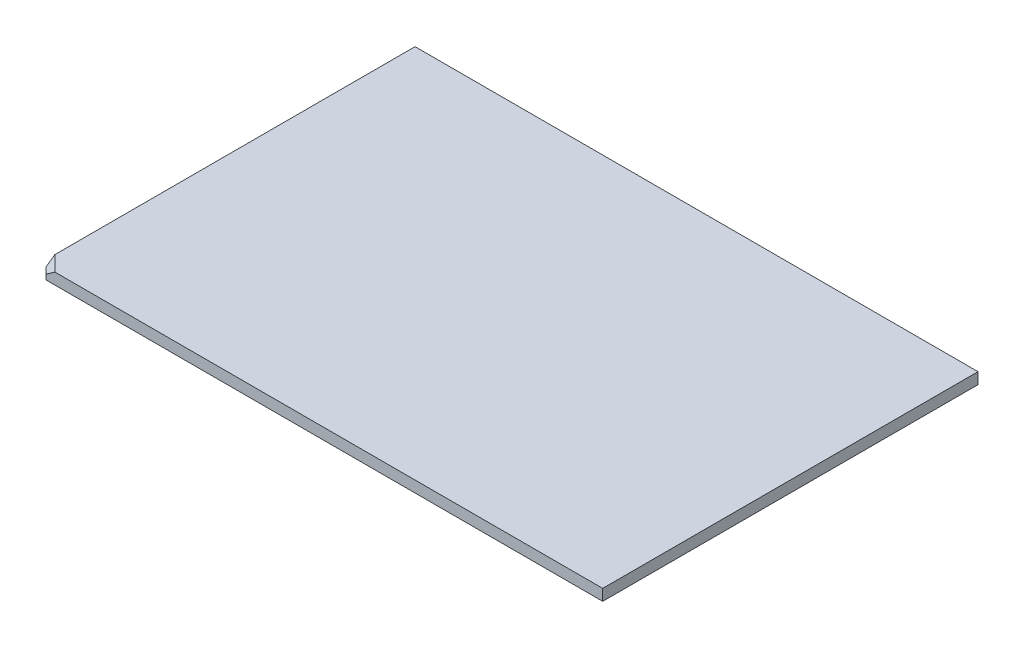
ISO-10303-21;
HEADER;
FILE_DESCRIPTION(('STEP AP214'),'2;1');
FILE_NAME('part.step','',(''),(''),'','','');
FILE_SCHEMA(('AUTOMOTIVE_DESIGN { 1 0 10303 214 1 1 1 1 }'));
ENDSEC;
DATA;
#1=APPLICATION_CONTEXT('core data for automotive mechanical design processes');
#2=APPLICATION_PROTOCOL_DEFINITION('international standard','automotive_design',2000,#1);
#3=PRODUCT_CONTEXT('',#1,'mechanical');
#4=PRODUCT('Part','Part','',(#3));
#5=PRODUCT_RELATED_PRODUCT_CATEGORY('part','',(#4));
#6=PRODUCT_DEFINITION_FORMATION('','',#4);
#7=PRODUCT_DEFINITION_CONTEXT('part definition',#1,'design');
#8=PRODUCT_DEFINITION('design','',#6,#7);
#9=PRODUCT_DEFINITION_SHAPE('','',#8);
#10=(LENGTH_UNIT() NAMED_UNIT(*) SI_UNIT(.MILLI.,.METRE.));
#11=(NAMED_UNIT(*) PLANE_ANGLE_UNIT() SI_UNIT($,.RADIAN.));
#12=(NAMED_UNIT(*) SI_UNIT($,.STERADIAN.) SOLID_ANGLE_UNIT());
#13=UNCERTAINTY_MEASURE_WITH_UNIT(LENGTH_MEASURE(1.E-05),#10,'distance_accuracy_value','');
#14=(GEOMETRIC_REPRESENTATION_CONTEXT(3) GLOBAL_UNCERTAINTY_ASSIGNED_CONTEXT((#13)) GLOBAL_UNIT_ASSIGNED_CONTEXT((#10,
#11,#12)) REPRESENTATION_CONTEXT('',''));
#15=CARTESIAN_POINT('',(0.,0.,0.));
#16=DIRECTION('',(0.,0.,1.));
#17=DIRECTION('',(1.,0.,0.));
#18=AXIS2_PLACEMENT_3D('',#15,#16,#17);
#19=CARTESIAN_POINT('',(-26.9712669172933,9.,-282.549436090226));
#20=DIRECTION('',(1.,0.,0.));
#21=DIRECTION('',(0.,0.,-1.));
#22=AXIS2_PLACEMENT_3D('',#19,#20,#21);
#23=PLANE('',#22);
#24=DIRECTION('',(0.,1.,0.));
#25=VECTOR('',#24,1.);
#26=CARTESIAN_POINT('',(-26.9712669172932,9.,12.4505639097744));
#27=LINE('',#26,#25);
#28=CARTESIAN_POINT('',(-26.9712669172932,0.,12.4505639097744));
#29=VERTEX_POINT('',#28);
#30=CARTESIAN_POINT('',(-26.9712669172932,3.99999999999999,12.4505639097744));
#31=VERTEX_POINT('',#30);
#32=EDGE_CURVE('E130',#29,#31,#27,.T.);
#33=ORIENTED_EDGE('',*,*,#32,.T.);
#34=DIRECTION('',(0.,0.577350269189624,-0.816496580927727));
#35=VECTOR('',#34,1.);
#36=CARTESIAN_POINT('',(-26.9712669172932,3.91077081192918,12.5767530377037));
#37=LINE('',#36,#35);
#38=CARTESIAN_POINT('',(-26.9712669172932,8.99999999999998,5.37949609790893));
#39=VERTEX_POINT('',#38);
#40=EDGE_CURVE('E11',#31,#39,#37,.T.);
#41=ORIENTED_EDGE('',*,*,#40,.T.);
#42=DIRECTION('',(0.,0.,1.));
#43=VECTOR('',#42,1.);
#44=CARTESIAN_POINT('',(-26.9712669172933,9.,-282.549436090226));
#45=LINE('',#44,#43);
#46=CARTESIAN_POINT('',(-26.9712669172933,9.,-282.549436090226));
#47=VERTEX_POINT('',#46);
#48=EDGE_CURVE('E95',#47,#39,#45,.T.);
#49=ORIENTED_EDGE('',*,*,#48,.F.);
#50=DIRECTION('',(0.,-1.,0.));
#51=VECTOR('',#50,1.);
#52=CARTESIAN_POINT('',(-26.9712669172933,9.,-282.549436090226));
#53=LINE('',#52,#51);
#54=CARTESIAN_POINT('',(-26.9712669172933,0.,-282.549436090226));
#55=VERTEX_POINT('',#54);
#56=EDGE_CURVE('E112',#47,#55,#53,.T.);
#57=ORIENTED_EDGE('',*,*,#56,.T.);
#58=DIRECTION('',(0.,0.,1.));
#59=VECTOR('',#58,1.);
#60=CARTESIAN_POINT('',(-26.9712669172933,0.,-282.549436090226));
#61=LINE('',#60,#59);
#62=EDGE_CURVE('E116',#55,#29,#61,.T.);
#63=ORIENTED_EDGE('',*,*,#62,.T.);
#64=EDGE_LOOP('',(#33,#41,#49,#57,#63));
#65=FACE_BOUND('',#64,.T.);
#66=ADVANCED_FACE('F35',(#65),#23,.F.);
#67=CARTESIAN_POINT('',(-26.9712669172932,9.,17.4505639097744));
#68=DIRECTION('',(0.,0.,-1.));
#69=DIRECTION('',(-1.,0.,0.));
#70=AXIS2_PLACEMENT_3D('',#67,#68,#69);
#71=PLANE('',#70);
#72=DIRECTION('',(1.,0.,0.));
#73=VECTOR('',#72,1.);
#74=CARTESIAN_POINT('',(-26.9712669172932,9.,17.4505639097744));
#75=LINE('',#74,#73);
#76=CARTESIAN_POINT('',(-14.9001991054277,9.,17.4505639097744));
#77=VERTEX_POINT('',#76);
#78=CARTESIAN_POINT('',(423.028733082707,9.,17.4505639097744));
#79=VERTEX_POINT('',#78);
#80=EDGE_CURVE('E86',#77,#79,#75,.T.);
#81=ORIENTED_EDGE('',*,*,#80,.F.);
#82=DIRECTION('',(-0.816496580927726,-0.577350269189626,0.));
#83=VECTOR('',#82,1.);
#84=CARTESIAN_POINT('',(-15.7503207068767,8.3988732507823,17.4505639097744));
#85=LINE('',#84,#83);
#86=CARTESIAN_POINT('',(-21.9712669172932,4.,17.4505639097744));
#87=VERTEX_POINT('',#86);
#88=EDGE_CURVE('E57',#77,#87,#85,.T.);
#89=ORIENTED_EDGE('',*,*,#88,.T.);
#90=DIRECTION('',(0.,-1.,0.));
#91=VECTOR('',#90,1.);
#92=CARTESIAN_POINT('',(-21.9712669172932,9.,17.4505639097744));
#93=LINE('',#92,#91);
#94=CARTESIAN_POINT('',(-21.9712669172932,0.,17.4505639097744));
#95=VERTEX_POINT('',#94);
#96=EDGE_CURVE('E104',#87,#95,#93,.T.);
#97=ORIENTED_EDGE('',*,*,#96,.T.);
#98=DIRECTION('',(1.,0.,0.));
#99=VECTOR('',#98,1.);
#100=CARTESIAN_POINT('',(-26.9712669172932,0.,17.4505639097744));
#101=LINE('',#100,#99);
#102=CARTESIAN_POINT('',(423.028733082707,0.,17.4505639097744));
#103=VERTEX_POINT('',#102);
#104=EDGE_CURVE('E101',#95,#103,#101,.T.);
#105=ORIENTED_EDGE('',*,*,#104,.T.);
#106=DIRECTION('',(0.,-1.,0.));
#107=VECTOR('',#106,1.);
#108=CARTESIAN_POINT('',(423.028733082707,9.,17.4505639097744));
#109=LINE('',#108,#107);
#110=EDGE_CURVE('E98',#79,#103,#109,.T.);
#111=ORIENTED_EDGE('',*,*,#110,.F.);
#112=EDGE_LOOP('',(#81,#89,#97,#105,#111));
#113=FACE_BOUND('',#112,.T.);
#114=ADVANCED_FACE('F99',(#113),#71,.F.);
#115=CARTESIAN_POINT('',(423.028733082707,9.,-282.549436090226));
#116=DIRECTION('',(-1.,0.,0.));
#117=DIRECTION('',(0.,0.,1.));
#118=AXIS2_PLACEMENT_3D('',#115,#116,#117);
#119=PLANE('',#118);
#120=DIRECTION('',(0.,0.,-1.));
#121=VECTOR('',#120,1.);
#122=CARTESIAN_POINT('',(423.028733082707,0.,-282.549436090226));
#123=LINE('',#122,#121);
#124=CARTESIAN_POINT('',(423.028733082707,0.,-282.549436090226));
#125=VERTEX_POINT('',#124);
#126=EDGE_CURVE('E120',#103,#125,#123,.T.);
#127=ORIENTED_EDGE('',*,*,#126,.T.);
#128=DIRECTION('',(0.,-1.,0.));
#129=VECTOR('',#128,1.);
#130=CARTESIAN_POINT('',(423.028733082707,9.,-282.549436090226));
#131=LINE('',#130,#129);
#132=CARTESIAN_POINT('',(423.028733082707,9.,-282.549436090226));
#133=VERTEX_POINT('',#132);
#134=EDGE_CURVE('E105',#133,#125,#131,.T.);
#135=ORIENTED_EDGE('',*,*,#134,.F.);
#136=DIRECTION('',(0.,0.,-1.));
#137=VECTOR('',#136,1.);
#138=CARTESIAN_POINT('',(423.028733082707,9.,-282.549436090226));
#139=LINE('',#138,#137);
#140=EDGE_CURVE('E91',#79,#133,#139,.T.);
#141=ORIENTED_EDGE('',*,*,#140,.F.);
#142=ORIENTED_EDGE('',*,*,#110,.T.);
#143=EDGE_LOOP('',(#127,#135,#141,#142));
#144=FACE_BOUND('',#143,.T.);
#145=ADVANCED_FACE('F107',(#144),#119,.F.);
#146=CARTESIAN_POINT('',(-26.9712669172933,9.,-282.549436090226));
#147=DIRECTION('',(0.,0.,1.));
#148=DIRECTION('',(1.,0.,0.));
#149=AXIS2_PLACEMENT_3D('',#146,#147,#148);
#150=PLANE('',#149);
#151=DIRECTION('',(-1.,0.,0.));
#152=VECTOR('',#151,1.);
#153=CARTESIAN_POINT('',(-26.9712669172933,0.,-282.549436090226));
#154=LINE('',#153,#152);
#155=EDGE_CURVE('E122',#125,#55,#154,.T.);
#156=ORIENTED_EDGE('',*,*,#155,.T.);
#157=ORIENTED_EDGE('',*,*,#56,.F.);
#158=DIRECTION('',(-1.,0.,0.));
#159=VECTOR('',#158,1.);
#160=CARTESIAN_POINT('',(-26.9712669172933,9.,-282.549436090226));
#161=LINE('',#160,#159);
#162=EDGE_CURVE('E110',#133,#47,#161,.T.);
#163=ORIENTED_EDGE('',*,*,#162,.F.);
#164=ORIENTED_EDGE('',*,*,#134,.T.);
#165=EDGE_LOOP('',(#156,#157,#163,#164));
#166=FACE_BOUND('',#165,.T.);
#167=ADVANCED_FACE('F155',(#166),#150,.F.);
#168=CARTESIAN_POINT('',(0.,9.,0.));
#169=DIRECTION('',(0.,1.,0.));
#170=DIRECTION('',(0.,0.,1.));
#171=AXIS2_PLACEMENT_3D('',#168,#169,#170);
#172=PLANE('',#171);
#173=ORIENTED_EDGE('',*,*,#48,.T.);
#174=DIRECTION('',(0.707106781186546,0.,0.707106781186549));
#175=VECTOR('',#174,1.);
#176=CARTESIAN_POINT('',(-16.1753815076011,9.,16.175381507601));
#177=LINE('',#176,#175);
#178=EDGE_CURVE('E94',#39,#77,#177,.T.);
#179=ORIENTED_EDGE('',*,*,#178,.T.);
#180=ORIENTED_EDGE('',*,*,#80,.T.);
#181=ORIENTED_EDGE('',*,*,#140,.T.);
#182=ORIENTED_EDGE('',*,*,#162,.T.);
#183=EDGE_LOOP('',(#173,#179,#180,#181,#182));
#184=FACE_BOUND('',#183,.T.);
#185=ADVANCED_FACE('F89',(#184),#172,.T.);
#186=CARTESIAN_POINT('',(0.,0.,0.));
#187=DIRECTION('',(0.,1.,0.));
#188=DIRECTION('',(0.,0.,1.));
#189=AXIS2_PLACEMENT_3D('',#186,#187,#188);
#190=PLANE('',#189);
#191=ORIENTED_EDGE('',*,*,#104,.F.);
#192=DIRECTION('',(0.707106781186546,0.,0.707106781186549));
#193=VECTOR('',#192,1.);
#194=CARTESIAN_POINT('',(-21.9712669172932,0.,17.4505639097744));
#195=LINE('',#194,#193);
#196=EDGE_CURVE('E128',#95,#29,#195,.F.);
#197=ORIENTED_EDGE('',*,*,#196,.T.);
#198=ORIENTED_EDGE('',*,*,#62,.F.);
#199=ORIENTED_EDGE('',*,*,#155,.F.);
#200=ORIENTED_EDGE('',*,*,#126,.F.);
#201=EDGE_LOOP('',(#191,#197,#198,#199,#200));
#202=FACE_BOUND('',#201,.T.);
#203=ADVANCED_FACE('F144',(#202),#190,.F.);
#204=CARTESIAN_POINT('',(-21.9712669172932,9.,17.4505639097744));
#205=DIRECTION('',(0.707106781186549,0.,-0.707106781186545));
#206=DIRECTION('',(0.,-1.,0.));
#207=AXIS2_PLACEMENT_3D('',#204,#205,#206);
#208=PLANE('',#207);
#209=ORIENTED_EDGE('',*,*,#96,.F.);
#210=DIRECTION('',(0.707106781186546,0.,0.707106781186549));
#211=VECTOR('',#210,1.);
#212=CARTESIAN_POINT('',(-21.9712669172932,4.,17.4505639097744));
#213=LINE('',#212,#211);
#214=EDGE_CURVE('E43',#87,#31,#213,.F.);
#215=ORIENTED_EDGE('',*,*,#214,.T.);
#216=ORIENTED_EDGE('',*,*,#32,.F.);
#217=ORIENTED_EDGE('',*,*,#196,.F.);
#218=EDGE_LOOP('',(#209,#215,#216,#217));
#219=FACE_BOUND('',#218,.T.);
#220=ADVANCED_FACE('F140',(#219),#208,.F.);
#221=CARTESIAN_POINT('',(-16.1753815076011,9.,16.175381507601));
#222=DIRECTION('',(-0.500000000000001,0.707106781186548,0.499999999999998));
#223=DIRECTION('',(-0.707106781186546,0.,-0.707106781186549));
#224=AXIS2_PLACEMENT_3D('',#221,#222,#223);
#225=PLANE('',#224);
#226=ORIENTED_EDGE('',*,*,#40,.F.);
#227=ORIENTED_EDGE('',*,*,#214,.F.);
#228=ORIENTED_EDGE('',*,*,#88,.F.);
#229=ORIENTED_EDGE('',*,*,#178,.F.);
#230=EDGE_LOOP('',(#226,#227,#228,#229));
#231=FACE_BOUND('',#230,.T.);
#232=ADVANCED_FACE('F37',(#231),#225,.T.);
#233=CLOSED_SHELL('',(#66,#114,#145,#167,#185,#203,#220,#232));
#234=MANIFOLD_SOLID_BREP('B2',#233);
#235=ADVANCED_BREP_SHAPE_REPRESENTATION('',(#18,#234),#14);
#236=SHAPE_DEFINITION_REPRESENTATION(#9,#235);
ENDSEC;
END-ISO-10303-21;
